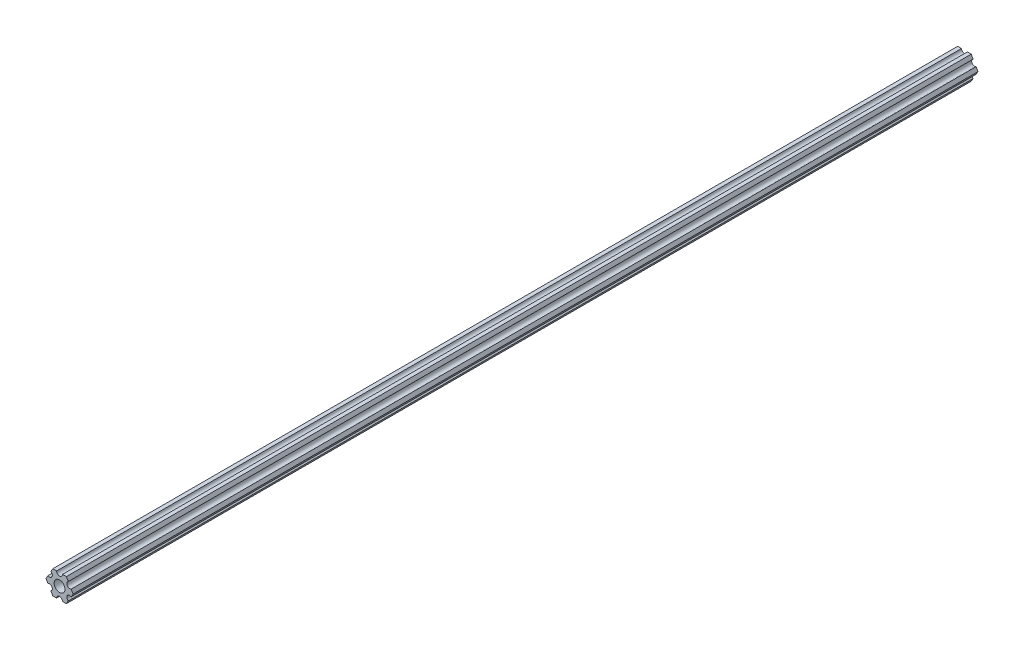
ISO-10303-21;
HEADER;
FILE_DESCRIPTION(('STEP AP214'),'2;1');
FILE_NAME('part.step','',(''),(''),'','','');
FILE_SCHEMA(('AUTOMOTIVE_DESIGN { 1 0 10303 214 1 1 1 1 }'));
ENDSEC;
DATA;
#1=APPLICATION_CONTEXT('core data for automotive mechanical design processes');
#2=APPLICATION_PROTOCOL_DEFINITION('international standard','automotive_design',2000,#1);
#3=PRODUCT_CONTEXT('',#1,'mechanical');
#4=PRODUCT('Part','Part','',(#3));
#5=PRODUCT_RELATED_PRODUCT_CATEGORY('part','',(#4));
#6=PRODUCT_DEFINITION_FORMATION('','',#4);
#7=PRODUCT_DEFINITION_CONTEXT('part definition',#1,'design');
#8=PRODUCT_DEFINITION('design','',#6,#7);
#9=PRODUCT_DEFINITION_SHAPE('','',#8);
#10=(LENGTH_UNIT() NAMED_UNIT(*) SI_UNIT(.MILLI.,.METRE.));
#11=(NAMED_UNIT(*) PLANE_ANGLE_UNIT() SI_UNIT($,.RADIAN.));
#12=(NAMED_UNIT(*) SI_UNIT($,.STERADIAN.) SOLID_ANGLE_UNIT());
#13=UNCERTAINTY_MEASURE_WITH_UNIT(LENGTH_MEASURE(1.E-05),#10,'distance_accuracy_value','');
#14=(GEOMETRIC_REPRESENTATION_CONTEXT(3) GLOBAL_UNCERTAINTY_ASSIGNED_CONTEXT((#13)) GLOBAL_UNIT_ASSIGNED_CONTEXT((#10,
#11,#12)) REPRESENTATION_CONTEXT('',''));
#15=CARTESIAN_POINT('',(0.,0.,0.));
#16=DIRECTION('',(0.,0.,1.));
#17=DIRECTION('',(1.,0.,0.));
#18=AXIS2_PLACEMENT_3D('',#15,#16,#17);
#19=CARTESIAN_POINT('',(5.49926112168156,3.17500033315933,488.95));
#20=DIRECTION('',(0.,0.,1.));
#21=DIRECTION('',(1.,0.,0.));
#22=AXIS2_PLACEMENT_3D('',#19,#20,#21);
#23=PLANE('',#22);
#24=DIRECTION('',(0.499999947533953,0.866025434075723,0.));
#25=VECTOR('',#24,1.);
#26=CARTESIAN_POINT('',(6.29301142309098,-1.80018429024546,488.95));
#27=LINE('',#26,#25);
#28=CARTESIAN_POINT('',(6.29301142309098,-1.80018429024546,488.95));
#29=VERTEX_POINT('',#28);
#30=CARTESIAN_POINT('',(7.33234841870826,4.44212519169686E-07,488.95));
#31=VERTEX_POINT('',#30);
#32=EDGE_CURVE('E226',#29,#31,#27,.T.);
#33=ORIENTED_EDGE('',*,*,#32,.T.);
#34=DIRECTION('',(-0.500000052466056,0.866025373493145,0.));
#35=VECTOR('',#34,1.);
#36=CARTESIAN_POINT('',(7.33234841870826,4.44212519169686E-07,488.95));
#37=LINE('',#36,#35);
#38=CARTESIAN_POINT('',(6.29301120497139,1.80018505273894,488.95));
#39=VERTEX_POINT('',#38);
#40=EDGE_CURVE('E124',#31,#39,#37,.T.);
#41=ORIENTED_EDGE('',*,*,#40,.T.);
#42=CARTESIAN_POINT('',(5.49926112168156,3.17500033315933,488.95));
#43=DIRECTION('',(0.,0.,-1.));
#44=DIRECTION('',(1.,0.,0.));
#45=AXIS2_PLACEMENT_3D('',#42,#43,#44);
#46=CIRCLE('',#45,1.5875);
#47=CARTESIAN_POINT('',(4.70551103839172,4.54981561357972,488.95));
#48=VERTEX_POINT('',#47);
#49=EDGE_CURVE('E271',#39,#48,#46,.T.);
#50=ORIENTED_EDGE('',*,*,#49,.T.);
#51=DIRECTION('',(-0.500000052466046,0.866025373493151,0.));
#52=VECTOR('',#51,1.);
#53=CARTESIAN_POINT('',(4.70551103839172,4.54981561357972,488.95));
#54=LINE('',#53,#52);
#55=CARTESIAN_POINT('',(3.66617382465481,6.35000022210627,488.95));
#56=VERTEX_POINT('',#55);
#57=EDGE_CURVE('E290',#48,#56,#54,.T.);
#58=ORIENTED_EDGE('',*,*,#57,.T.);
#59=DIRECTION('',(-0.999999999999998,-6.05825850611185E-08,0.));
#60=VECTOR('',#59,1.);
#61=CARTESIAN_POINT('',(3.66617382465481,6.35000022210627,488.95));
#62=LINE('',#61,#60);
#63=CARTESIAN_POINT('',(1.58749961530074,6.35000009617482,488.95));
#64=VERTEX_POINT('',#63);
#65=EDGE_CURVE('E287',#56,#64,#62,.T.);
#66=ORIENTED_EDGE('',*,*,#65,.T.);
#67=CARTESIAN_POINT('',(-3.84699260060323E-07,6.35,488.95));
#68=DIRECTION('',(0.,0.,-1.));
#69=DIRECTION('',(1.,0.,0.));
#70=AXIS2_PLACEMENT_3D('',#67,#68,#69);
#71=CIRCLE('',#70,1.5875);
#72=CARTESIAN_POINT('',(-1.58750038469926,6.34999990382518,488.95));
#73=VERTEX_POINT('',#72);
#74=EDGE_CURVE('E289',#64,#73,#71,.T.);
#75=ORIENTED_EDGE('',*,*,#74,.T.);
#76=DIRECTION('',(-0.999999999999998,-6.05825963273174E-08,0.));
#77=VECTOR('',#76,1.);
#78=CARTESIAN_POINT('',(-1.58750038469926,6.34999990382518,488.95));
#79=LINE('',#78,#77);
#80=CARTESIAN_POINT('',(-3.66617459405349,6.3499997778937,488.95));
#81=VERTEX_POINT('',#80);
#82=EDGE_CURVE('E292',#73,#81,#79,.T.);
#83=ORIENTED_EDGE('',*,*,#82,.T.);
#84=DIRECTION('',(-0.499999947533942,-0.866025434075729,0.));
#85=VECTOR('',#84,1.);
#86=CARTESIAN_POINT('',(-3.66617459405349,6.3499997778937,488.95));
#87=LINE('',#86,#85);
#88=CARTESIAN_POINT('',(-4.70551158967065,4.54981504343587,488.95));
#89=VERTEX_POINT('',#88);
#90=EDGE_CURVE('E298',#81,#89,#87,.T.);
#91=ORIENTED_EDGE('',*,*,#90,.T.);
#92=CARTESIAN_POINT('',(-5.49926150638082,3.17499966684067,488.95));
#93=DIRECTION('',(0.,0.,-1.));
#94=DIRECTION('',(1.,0.,0.));
#95=AXIS2_PLACEMENT_3D('',#92,#93,#94);
#96=CIRCLE('',#95,1.5875);
#97=CARTESIAN_POINT('',(-6.29301142309098,1.80018429024547,488.95));
#98=VERTEX_POINT('',#97);
#99=EDGE_CURVE('E300',#89,#98,#96,.T.);
#100=ORIENTED_EDGE('',*,*,#99,.T.);
#101=DIRECTION('',(-0.499999947533951,-0.866025434075724,0.));
#102=VECTOR('',#101,1.);
#103=CARTESIAN_POINT('',(-6.29301142309098,1.80018429024547,488.95));
#104=LINE('',#103,#102);
#105=CARTESIAN_POINT('',(-7.33234841870826,-4.44212523790841E-07,488.95));
#106=VERTEX_POINT('',#105);
#107=EDGE_CURVE('E302',#98,#106,#104,.T.);
#108=ORIENTED_EDGE('',*,*,#107,.T.);
#109=DIRECTION('',(0.500000052466045,-0.866025373493151,0.));
#110=VECTOR('',#109,1.);
#111=CARTESIAN_POINT('',(-7.33234841870826,-4.44212523790841E-07,488.95));
#112=LINE('',#111,#110);
#113=CARTESIAN_POINT('',(-6.29301120497141,-1.80018505273897,488.95));
#114=VERTEX_POINT('',#113);
#115=EDGE_CURVE('E304',#106,#114,#112,.T.);
#116=ORIENTED_EDGE('',*,*,#115,.T.);
#117=CARTESIAN_POINT('',(-5.49926112168156,-3.17500033315934,488.95));
#118=DIRECTION('',(0.,0.,-1.));
#119=DIRECTION('',(1.,0.,0.));
#120=AXIS2_PLACEMENT_3D('',#117,#118,#119);
#121=CIRCLE('',#120,1.5875);
#122=CARTESIAN_POINT('',(-4.70551103839172,-4.54981561357972,488.95));
#123=VERTEX_POINT('',#122);
#124=EDGE_CURVE('E306',#114,#123,#121,.T.);
#125=ORIENTED_EDGE('',*,*,#124,.T.);
#126=DIRECTION('',(0.500000052466045,-0.866025373493151,0.));
#127=VECTOR('',#126,1.);
#128=CARTESIAN_POINT('',(-4.70551103839172,-4.54981561357972,488.95));
#129=LINE('',#128,#127);
#130=CARTESIAN_POINT('',(-3.66617382465481,-6.35000022210628,488.95));
#131=VERTEX_POINT('',#130);
#132=EDGE_CURVE('E308',#123,#131,#129,.T.);
#133=ORIENTED_EDGE('',*,*,#132,.T.);
#134=DIRECTION('',(0.999999999999998,6.05825854783851E-08,0.));
#135=VECTOR('',#134,1.);
#136=CARTESIAN_POINT('',(-3.66617382465481,-6.35000022210628,488.95));
#137=LINE('',#136,#135);
#138=CARTESIAN_POINT('',(-1.58749961530074,-6.35000009617482,488.95));
#139=VERTEX_POINT('',#138);
#140=EDGE_CURVE('E310',#131,#139,#137,.T.);
#141=ORIENTED_EDGE('',*,*,#140,.T.);
#142=CARTESIAN_POINT('',(3.8469926204343E-07,-6.35,488.95));
#143=DIRECTION('',(0.,0.,-1.));
#144=DIRECTION('',(1.,0.,0.));
#145=AXIS2_PLACEMENT_3D('',#142,#143,#144);
#146=CIRCLE('',#145,1.5875);
#147=CARTESIAN_POINT('',(1.58750038469926,-6.34999990382518,488.95));
#148=VERTEX_POINT('',#147);
#149=EDGE_CURVE('E173',#139,#148,#146,.T.);
#150=ORIENTED_EDGE('',*,*,#149,.T.);
#151=DIRECTION('',(0.999999999999998,6.05825721258438E-08,0.));
#152=VECTOR('',#151,1.);
#153=CARTESIAN_POINT('',(1.58750038469926,-6.34999990382518,488.95));
#154=LINE('',#153,#152);
#155=CARTESIAN_POINT('',(3.66617459405346,-6.34999977789375,488.95));
#156=VERTEX_POINT('',#155);
#157=EDGE_CURVE('E167',#148,#156,#154,.T.);
#158=ORIENTED_EDGE('',*,*,#157,.T.);
#159=DIRECTION('',(0.499999947533941,0.86602543407573,0.));
#160=VECTOR('',#159,1.);
#161=CARTESIAN_POINT('',(3.66617459405346,-6.34999977789375,488.95));
#162=LINE('',#161,#160);
#163=CARTESIAN_POINT('',(4.70551158967065,-4.54981504343587,488.95));
#164=VERTEX_POINT('',#163);
#165=EDGE_CURVE('E171',#156,#164,#162,.T.);
#166=ORIENTED_EDGE('',*,*,#165,.T.);
#167=CARTESIAN_POINT('',(5.49926150638082,-3.17499966684067,488.95));
#168=DIRECTION('',(0.,0.,-1.));
#169=DIRECTION('',(1.,0.,0.));
#170=AXIS2_PLACEMENT_3D('',#167,#168,#169);
#171=CIRCLE('',#170,1.58750000000001);
#172=EDGE_CURVE('E51',#164,#29,#171,.T.);
#173=ORIENTED_EDGE('',*,*,#172,.T.);
#174=EDGE_LOOP('',(#33,#41,#50,#58,#66,#75,#83,#91,#100,#108,#116,#125,#133,#141,#150,#158,#166,#173));
#175=FACE_BOUND('',#174,.T.);
#176=CARTESIAN_POINT('',(0.,0.,488.95));
#177=DIRECTION('',(0.,0.,1.));
#178=DIRECTION('',(1.,0.,0.));
#179=AXIS2_PLACEMENT_3D('',#176,#177,#178);
#180=CIRCLE('',#179,2.9337);
#181=CARTESIAN_POINT('',(2.9337,0.,488.95));
#182=VERTEX_POINT('',#181);
#183=EDGE_CURVE('E195',#182,#182,#180,.T.);
#184=ORIENTED_EDGE('',*,*,#183,.F.);
#185=EDGE_LOOP('',(#184));
#186=FACE_BOUND('',#185,.T.);
#187=ADVANCED_FACE('F34',(#175,#186),#23,.T.);
#188=CARTESIAN_POINT('',(5.49926112168156,3.17500033315933,0.));
#189=DIRECTION('',(0.,0.,1.));
#190=DIRECTION('',(1.,0.,0.));
#191=AXIS2_PLACEMENT_3D('',#188,#189,#190);
#192=PLANE('',#191);
#193=DIRECTION('',(0.499999947533953,0.866025434075723,0.));
#194=VECTOR('',#193,1.);
#195=CARTESIAN_POINT('',(6.29301142309098,-1.80018429024546,0.));
#196=LINE('',#195,#194);
#197=CARTESIAN_POINT('',(6.29301142309098,-1.80018429024546,0.));
#198=VERTEX_POINT('',#197);
#199=CARTESIAN_POINT('',(7.33234841870826,4.44212519169686E-07,0.));
#200=VERTEX_POINT('',#199);
#201=EDGE_CURVE('E191',#198,#200,#196,.T.);
#202=ORIENTED_EDGE('',*,*,#201,.F.);
#203=CARTESIAN_POINT('',(5.49926150638082,-3.17499966684067,0.));
#204=DIRECTION('',(0.,0.,-1.));
#205=DIRECTION('',(1.,0.,0.));
#206=AXIS2_PLACEMENT_3D('',#203,#204,#205);
#207=CIRCLE('',#206,1.58750000000001);
#208=CARTESIAN_POINT('',(4.70551158967065,-4.54981504343587,0.));
#209=VERTEX_POINT('',#208);
#210=EDGE_CURVE('E116',#209,#198,#207,.T.);
#211=ORIENTED_EDGE('',*,*,#210,.F.);
#212=DIRECTION('',(0.499999947533941,0.86602543407573,0.));
#213=VECTOR('',#212,1.);
#214=CARTESIAN_POINT('',(3.66617459405346,-6.34999977789375,0.));
#215=LINE('',#214,#213);
#216=CARTESIAN_POINT('',(3.66617459405346,-6.34999977789375,0.));
#217=VERTEX_POINT('',#216);
#218=EDGE_CURVE('E110',#217,#209,#215,.T.);
#219=ORIENTED_EDGE('',*,*,#218,.F.);
#220=DIRECTION('',(0.999999999999998,6.05825721258438E-08,0.));
#221=VECTOR('',#220,1.);
#222=CARTESIAN_POINT('',(1.58750038469926,-6.34999990382518,0.));
#223=LINE('',#222,#221);
#224=CARTESIAN_POINT('',(1.58750038469926,-6.34999990382518,0.));
#225=VERTEX_POINT('',#224);
#226=EDGE_CURVE('E181',#225,#217,#223,.T.);
#227=ORIENTED_EDGE('',*,*,#226,.F.);
#228=CARTESIAN_POINT('',(3.8469926204343E-07,-6.35,0.));
#229=DIRECTION('',(0.,0.,-1.));
#230=DIRECTION('',(1.,0.,0.));
#231=AXIS2_PLACEMENT_3D('',#228,#229,#230);
#232=CIRCLE('',#231,1.5875);
#233=CARTESIAN_POINT('',(-1.58749961530074,-6.35000009617482,0.));
#234=VERTEX_POINT('',#233);
#235=EDGE_CURVE('E221',#234,#225,#232,.T.);
#236=ORIENTED_EDGE('',*,*,#235,.F.);
#237=DIRECTION('',(0.999999999999998,6.05825854783851E-08,0.));
#238=VECTOR('',#237,1.);
#239=CARTESIAN_POINT('',(-3.66617382465481,-6.35000022210628,0.));
#240=LINE('',#239,#238);
#241=CARTESIAN_POINT('',(-3.66617382465481,-6.35000022210628,0.));
#242=VERTEX_POINT('',#241);
#243=EDGE_CURVE('E219',#242,#234,#240,.T.);
#244=ORIENTED_EDGE('',*,*,#243,.F.);
#245=DIRECTION('',(0.500000052466045,-0.866025373493151,0.));
#246=VECTOR('',#245,1.);
#247=CARTESIAN_POINT('',(-4.70551103839172,-4.54981561357972,0.));
#248=LINE('',#247,#246);
#249=CARTESIAN_POINT('',(-4.70551103839172,-4.54981561357972,0.));
#250=VERTEX_POINT('',#249);
#251=EDGE_CURVE('E217',#250,#242,#248,.T.);
#252=ORIENTED_EDGE('',*,*,#251,.F.);
#253=CARTESIAN_POINT('',(-5.49926112168156,-3.17500033315934,0.));
#254=DIRECTION('',(0.,0.,-1.));
#255=DIRECTION('',(1.,0.,0.));
#256=AXIS2_PLACEMENT_3D('',#253,#254,#255);
#257=CIRCLE('',#256,1.5875);
#258=CARTESIAN_POINT('',(-6.29301120497141,-1.80018505273897,0.));
#259=VERTEX_POINT('',#258);
#260=EDGE_CURVE('E215',#259,#250,#257,.T.);
#261=ORIENTED_EDGE('',*,*,#260,.F.);
#262=DIRECTION('',(0.500000052466045,-0.866025373493151,0.));
#263=VECTOR('',#262,1.);
#264=CARTESIAN_POINT('',(-7.33234841870826,-4.44212523790841E-07,0.));
#265=LINE('',#264,#263);
#266=CARTESIAN_POINT('',(-7.33234841870826,-4.44212523790841E-07,0.));
#267=VERTEX_POINT('',#266);
#268=EDGE_CURVE('E213',#267,#259,#265,.T.);
#269=ORIENTED_EDGE('',*,*,#268,.F.);
#270=DIRECTION('',(-0.499999947533951,-0.866025434075724,0.));
#271=VECTOR('',#270,1.);
#272=CARTESIAN_POINT('',(-6.29301142309098,1.80018429024547,0.));
#273=LINE('',#272,#271);
#274=CARTESIAN_POINT('',(-6.29301142309098,1.80018429024547,0.));
#275=VERTEX_POINT('',#274);
#276=EDGE_CURVE('E211',#275,#267,#273,.T.);
#277=ORIENTED_EDGE('',*,*,#276,.F.);
#278=CARTESIAN_POINT('',(-5.49926150638082,3.17499966684067,0.));
#279=DIRECTION('',(0.,0.,-1.));
#280=DIRECTION('',(1.,0.,0.));
#281=AXIS2_PLACEMENT_3D('',#278,#279,#280);
#282=CIRCLE('',#281,1.5875);
#283=CARTESIAN_POINT('',(-4.70551158967065,4.54981504343587,0.));
#284=VERTEX_POINT('',#283);
#285=EDGE_CURVE('E209',#284,#275,#282,.T.);
#286=ORIENTED_EDGE('',*,*,#285,.F.);
#287=DIRECTION('',(-0.499999947533942,-0.866025434075729,0.));
#288=VECTOR('',#287,1.);
#289=CARTESIAN_POINT('',(-3.66617459405349,6.3499997778937,0.));
#290=LINE('',#289,#288);
#291=CARTESIAN_POINT('',(-3.66617459405349,6.3499997778937,0.));
#292=VERTEX_POINT('',#291);
#293=EDGE_CURVE('E207',#292,#284,#290,.T.);
#294=ORIENTED_EDGE('',*,*,#293,.F.);
#295=DIRECTION('',(-0.999999999999998,-6.05825963273174E-08,0.));
#296=VECTOR('',#295,1.);
#297=CARTESIAN_POINT('',(-1.58750038469926,6.34999990382518,0.));
#298=LINE('',#297,#296);
#299=CARTESIAN_POINT('',(-1.58750038469926,6.34999990382518,0.));
#300=VERTEX_POINT('',#299);
#301=EDGE_CURVE('E205',#300,#292,#298,.T.);
#302=ORIENTED_EDGE('',*,*,#301,.F.);
#303=CARTESIAN_POINT('',(-3.84699260060323E-07,6.35,0.));
#304=DIRECTION('',(0.,0.,-1.));
#305=DIRECTION('',(1.,0.,0.));
#306=AXIS2_PLACEMENT_3D('',#303,#304,#305);
#307=CIRCLE('',#306,1.5875);
#308=CARTESIAN_POINT('',(1.58749961530074,6.35000009617482,0.));
#309=VERTEX_POINT('',#308);
#310=EDGE_CURVE('E203',#309,#300,#307,.T.);
#311=ORIENTED_EDGE('',*,*,#310,.F.);
#312=DIRECTION('',(-0.999999999999998,-6.05825850611185E-08,0.));
#313=VECTOR('',#312,1.);
#314=CARTESIAN_POINT('',(3.66617382465481,6.35000022210627,0.));
#315=LINE('',#314,#313);
#316=CARTESIAN_POINT('',(3.66617382465481,6.35000022210627,0.));
#317=VERTEX_POINT('',#316);
#318=EDGE_CURVE('E201',#317,#309,#315,.T.);
#319=ORIENTED_EDGE('',*,*,#318,.F.);
#320=DIRECTION('',(-0.500000052466046,0.866025373493151,0.));
#321=VECTOR('',#320,1.);
#322=CARTESIAN_POINT('',(4.70551103839172,4.54981561357972,0.));
#323=LINE('',#322,#321);
#324=CARTESIAN_POINT('',(4.70551103839172,4.54981561357972,0.));
#325=VERTEX_POINT('',#324);
#326=EDGE_CURVE('E199',#325,#317,#323,.T.);
#327=ORIENTED_EDGE('',*,*,#326,.F.);
#328=CARTESIAN_POINT('',(5.49926112168156,3.17500033315933,0.));
#329=DIRECTION('',(0.,0.,-1.));
#330=DIRECTION('',(1.,0.,0.));
#331=AXIS2_PLACEMENT_3D('',#328,#329,#330);
#332=CIRCLE('',#331,1.5875);
#333=CARTESIAN_POINT('',(6.29301120497139,1.80018505273894,0.));
#334=VERTEX_POINT('',#333);
#335=EDGE_CURVE('E197',#334,#325,#332,.T.);
#336=ORIENTED_EDGE('',*,*,#335,.F.);
#337=DIRECTION('',(-0.500000052466056,0.866025373493145,0.));
#338=VECTOR('',#337,1.);
#339=CARTESIAN_POINT('',(7.33234841870826,4.44212519169686E-07,0.));
#340=LINE('',#339,#338);
#341=EDGE_CURVE('E194',#200,#334,#340,.T.);
#342=ORIENTED_EDGE('',*,*,#341,.F.);
#343=EDGE_LOOP('',(#202,#211,#219,#227,#236,#244,#252,#261,#269,#277,#286,#294,#302,#311,#319,
#327,#336,#342));
#344=FACE_BOUND('',#343,.T.);
#345=CARTESIAN_POINT('',(0.,0.,0.));
#346=DIRECTION('',(0.,0.,1.));
#347=DIRECTION('',(1.,0.,0.));
#348=AXIS2_PLACEMENT_3D('',#345,#346,#347);
#349=CIRCLE('',#348,2.9337);
#350=CARTESIAN_POINT('',(2.9337,0.,0.));
#351=VERTEX_POINT('',#350);
#352=EDGE_CURVE('E535',#351,#351,#349,.T.);
#353=ORIENTED_EDGE('',*,*,#352,.T.);
#354=EDGE_LOOP('',(#353));
#355=FACE_BOUND('',#354,.T.);
#356=ADVANCED_FACE('F275',(#344,#355),#192,.F.);
#357=CARTESIAN_POINT('',(6.29301142309098,-1.80018429024546,488.95));
#358=DIRECTION('',(-0.866025434075723,0.499999947533953,0.));
#359=DIRECTION('',(-0.499999947533953,-0.866025434075723,0.));
#360=AXIS2_PLACEMENT_3D('',#357,#358,#359);
#361=PLANE('',#360);
#362=ORIENTED_EDGE('',*,*,#201,.T.);
#363=DIRECTION('',(0.,0.,-1.));
#364=VECTOR('',#363,1.);
#365=CARTESIAN_POINT('',(7.33234841870826,4.44212519169686E-07,488.95));
#366=LINE('',#365,#364);
#367=EDGE_CURVE('E11',#31,#200,#366,.T.);
#368=ORIENTED_EDGE('',*,*,#367,.F.);
#369=ORIENTED_EDGE('',*,*,#32,.F.);
#370=DIRECTION('',(0.,0.,-1.));
#371=VECTOR('',#370,1.);
#372=CARTESIAN_POINT('',(6.29301142309098,-1.80018429024546,488.95));
#373=LINE('',#372,#371);
#374=EDGE_CURVE('E187',#29,#198,#373,.T.);
#375=ORIENTED_EDGE('',*,*,#374,.T.);
#376=EDGE_LOOP('',(#362,#368,#369,#375));
#377=FACE_BOUND('',#376,.T.);
#378=ADVANCED_FACE('F36',(#377),#361,.F.);
#379=CARTESIAN_POINT('',(7.33234841870826,4.44212519169686E-07,488.95));
#380=DIRECTION('',(-0.866025373493145,-0.500000052466057,0.));
#381=DIRECTION('',(0.500000052466056,-0.866025373493145,0.));
#382=AXIS2_PLACEMENT_3D('',#379,#380,#381);
#383=PLANE('',#382);
#384=ORIENTED_EDGE('',*,*,#341,.T.);
#385=DIRECTION('',(0.,0.,-1.));
#386=VECTOR('',#385,1.);
#387=CARTESIAN_POINT('',(6.29301120497139,1.80018505273894,488.95));
#388=LINE('',#387,#386);
#389=EDGE_CURVE('E43',#39,#334,#388,.T.);
#390=ORIENTED_EDGE('',*,*,#389,.F.);
#391=ORIENTED_EDGE('',*,*,#40,.F.);
#392=ORIENTED_EDGE('',*,*,#367,.T.);
#393=EDGE_LOOP('',(#384,#390,#391,#392));
#394=FACE_BOUND('',#393,.T.);
#395=ADVANCED_FACE('F344',(#394),#383,.F.);
#396=CARTESIAN_POINT('',(5.49926112168156,3.17500033315933,488.95));
#397=DIRECTION('',(0.,0.,-1.));
#398=DIRECTION('',(-1.,0.,0.));
#399=AXIS2_PLACEMENT_3D('',#396,#397,#398);
#400=CYLINDRICAL_SURFACE('',#399,1.5875);
#401=ORIENTED_EDGE('',*,*,#335,.T.);
#402=DIRECTION('',(0.,0.,-1.));
#403=VECTOR('',#402,1.);
#404=CARTESIAN_POINT('',(4.70551103839172,4.54981561357972,488.95));
#405=LINE('',#404,#403);
#406=EDGE_CURVE('E263',#48,#325,#405,.T.);
#407=ORIENTED_EDGE('',*,*,#406,.F.);
#408=ORIENTED_EDGE('',*,*,#49,.F.);
#409=ORIENTED_EDGE('',*,*,#389,.T.);
#410=EDGE_LOOP('',(#401,#407,#408,#409));
#411=FACE_BOUND('',#410,.T.);
#412=ADVANCED_FACE('F269',(#411),#400,.F.);
#413=CARTESIAN_POINT('',(4.70551103839172,4.54981561357972,488.95));
#414=DIRECTION('',(-0.866025373493151,-0.500000052466046,0.));
#415=DIRECTION('',(0.500000052466046,-0.866025373493151,0.));
#416=AXIS2_PLACEMENT_3D('',#413,#414,#415);
#417=PLANE('',#416);
#418=ORIENTED_EDGE('',*,*,#326,.T.);
#419=DIRECTION('',(0.,0.,-1.));
#420=VECTOR('',#419,1.);
#421=CARTESIAN_POINT('',(3.66617382465481,6.35000022210627,488.95));
#422=LINE('',#421,#420);
#423=EDGE_CURVE('E260',#56,#317,#422,.T.);
#424=ORIENTED_EDGE('',*,*,#423,.F.);
#425=ORIENTED_EDGE('',*,*,#57,.F.);
#426=ORIENTED_EDGE('',*,*,#406,.T.);
#427=EDGE_LOOP('',(#418,#424,#425,#426));
#428=FACE_BOUND('',#427,.T.);
#429=ADVANCED_FACE('F281',(#428),#417,.F.);
#430=CARTESIAN_POINT('',(3.66617382465481,6.35000022210627,488.95));
#431=DIRECTION('',(6.05825850611185E-08,-0.999999999999998,0.));
#432=DIRECTION('',(0.999999999999998,6.05825850611185E-08,0.));
#433=AXIS2_PLACEMENT_3D('',#430,#431,#432);
#434=PLANE('',#433);
#435=ORIENTED_EDGE('',*,*,#318,.T.);
#436=DIRECTION('',(0.,0.,-1.));
#437=VECTOR('',#436,1.);
#438=CARTESIAN_POINT('',(1.58749961530074,6.35000009617482,488.95));
#439=LINE('',#438,#437);
#440=EDGE_CURVE('E257',#64,#309,#439,.T.);
#441=ORIENTED_EDGE('',*,*,#440,.F.);
#442=ORIENTED_EDGE('',*,*,#65,.F.);
#443=ORIENTED_EDGE('',*,*,#423,.T.);
#444=EDGE_LOOP('',(#435,#441,#442,#443));
#445=FACE_BOUND('',#444,.T.);
#446=ADVANCED_FACE('F285',(#445),#434,.F.);
#447=CARTESIAN_POINT('',(-3.84699260060323E-07,6.35,488.95));
#448=DIRECTION('',(0.,0.,-1.));
#449=DIRECTION('',(-1.,0.,0.));
#450=AXIS2_PLACEMENT_3D('',#447,#448,#449);
#451=CYLINDRICAL_SURFACE('',#450,1.5875);
#452=ORIENTED_EDGE('',*,*,#310,.T.);
#453=DIRECTION('',(0.,0.,-1.));
#454=VECTOR('',#453,1.);
#455=CARTESIAN_POINT('',(-1.58750038469926,6.34999990382518,488.95));
#456=LINE('',#455,#454);
#457=EDGE_CURVE('E254',#73,#300,#456,.T.);
#458=ORIENTED_EDGE('',*,*,#457,.F.);
#459=ORIENTED_EDGE('',*,*,#74,.F.);
#460=ORIENTED_EDGE('',*,*,#440,.T.);
#461=EDGE_LOOP('',(#452,#458,#459,#460));
#462=FACE_BOUND('',#461,.T.);
#463=ADVANCED_FACE('F357',(#462),#451,.F.);
#464=CARTESIAN_POINT('',(-1.58750038469926,6.34999990382518,488.95));
#465=DIRECTION('',(6.05825963273174E-08,-0.999999999999998,0.));
#466=DIRECTION('',(0.999999999999998,6.05825963273174E-08,0.));
#467=AXIS2_PLACEMENT_3D('',#464,#465,#466);
#468=PLANE('',#467);
#469=ORIENTED_EDGE('',*,*,#301,.T.);
#470=DIRECTION('',(0.,0.,-1.));
#471=VECTOR('',#470,1.);
#472=CARTESIAN_POINT('',(-3.66617459405349,6.3499997778937,488.95));
#473=LINE('',#472,#471);
#474=EDGE_CURVE('E251',#81,#292,#473,.T.);
#475=ORIENTED_EDGE('',*,*,#474,.F.);
#476=ORIENTED_EDGE('',*,*,#82,.F.);
#477=ORIENTED_EDGE('',*,*,#457,.T.);
#478=EDGE_LOOP('',(#469,#475,#476,#477));
#479=FACE_BOUND('',#478,.T.);
#480=ADVANCED_FACE('F360',(#479),#468,.F.);
#481=CARTESIAN_POINT('',(-3.66617459405349,6.3499997778937,488.95));
#482=DIRECTION('',(0.866025434075729,-0.499999947533942,0.));
#483=DIRECTION('',(0.499999947533943,0.866025434075729,0.));
#484=AXIS2_PLACEMENT_3D('',#481,#482,#483);
#485=PLANE('',#484);
#486=ORIENTED_EDGE('',*,*,#293,.T.);
#487=DIRECTION('',(0.,0.,-1.));
#488=VECTOR('',#487,1.);
#489=CARTESIAN_POINT('',(-4.70551158967065,4.54981504343587,488.95));
#490=LINE('',#489,#488);
#491=EDGE_CURVE('E248',#89,#284,#490,.T.);
#492=ORIENTED_EDGE('',*,*,#491,.F.);
#493=ORIENTED_EDGE('',*,*,#90,.F.);
#494=ORIENTED_EDGE('',*,*,#474,.T.);
#495=EDGE_LOOP('',(#486,#492,#493,#494));
#496=FACE_BOUND('',#495,.T.);
#497=ADVANCED_FACE('F364',(#496),#485,.F.);
#498=CARTESIAN_POINT('',(-5.49926150638082,3.17499966684067,488.95));
#499=DIRECTION('',(0.,0.,-1.));
#500=DIRECTION('',(-1.,0.,0.));
#501=AXIS2_PLACEMENT_3D('',#498,#499,#500);
#502=CYLINDRICAL_SURFACE('',#501,1.5875);
#503=ORIENTED_EDGE('',*,*,#285,.T.);
#504=DIRECTION('',(0.,0.,-1.));
#505=VECTOR('',#504,1.);
#506=CARTESIAN_POINT('',(-6.29301142309098,1.80018429024547,488.95));
#507=LINE('',#506,#505);
#508=EDGE_CURVE('E245',#98,#275,#507,.T.);
#509=ORIENTED_EDGE('',*,*,#508,.F.);
#510=ORIENTED_EDGE('',*,*,#99,.F.);
#511=ORIENTED_EDGE('',*,*,#491,.T.);
#512=EDGE_LOOP('',(#503,#509,#510,#511));
#513=FACE_BOUND('',#512,.T.);
#514=ADVANCED_FACE('F368',(#513),#502,.F.);
#515=CARTESIAN_POINT('',(-6.29301142309098,1.80018429024547,488.95));
#516=DIRECTION('',(0.866025434075724,-0.499999947533952,0.));
#517=DIRECTION('',(0.499999947533952,0.866025434075724,0.));
#518=AXIS2_PLACEMENT_3D('',#515,#516,#517);
#519=PLANE('',#518);
#520=ORIENTED_EDGE('',*,*,#276,.T.);
#521=DIRECTION('',(0.,0.,-1.));
#522=VECTOR('',#521,1.);
#523=CARTESIAN_POINT('',(-7.33234841870826,-4.44212523790841E-07,488.95));
#524=LINE('',#523,#522);
#525=EDGE_CURVE('E242',#106,#267,#524,.T.);
#526=ORIENTED_EDGE('',*,*,#525,.F.);
#527=ORIENTED_EDGE('',*,*,#107,.F.);
#528=ORIENTED_EDGE('',*,*,#508,.T.);
#529=EDGE_LOOP('',(#520,#526,#527,#528));
#530=FACE_BOUND('',#529,.T.);
#531=ADVANCED_FACE('F372',(#530),#519,.F.);
#532=CARTESIAN_POINT('',(-7.33234841870826,-4.44212523790841E-07,488.95));
#533=DIRECTION('',(0.866025373493151,0.500000052466045,0.));
#534=DIRECTION('',(-0.500000052466045,0.866025373493151,0.));
#535=AXIS2_PLACEMENT_3D('',#532,#533,#534);
#536=PLANE('',#535);
#537=ORIENTED_EDGE('',*,*,#268,.T.);
#538=DIRECTION('',(0.,0.,-1.));
#539=VECTOR('',#538,1.);
#540=CARTESIAN_POINT('',(-6.29301120497141,-1.80018505273897,488.95));
#541=LINE('',#540,#539);
#542=EDGE_CURVE('E239',#114,#259,#541,.T.);
#543=ORIENTED_EDGE('',*,*,#542,.F.);
#544=ORIENTED_EDGE('',*,*,#115,.F.);
#545=ORIENTED_EDGE('',*,*,#525,.T.);
#546=EDGE_LOOP('',(#537,#543,#544,#545));
#547=FACE_BOUND('',#546,.T.);
#548=ADVANCED_FACE('F376',(#547),#536,.F.);
#549=CARTESIAN_POINT('',(-5.49926112168156,-3.17500033315934,488.95));
#550=DIRECTION('',(0.,0.,-1.));
#551=DIRECTION('',(-1.,0.,0.));
#552=AXIS2_PLACEMENT_3D('',#549,#550,#551);
#553=CYLINDRICAL_SURFACE('',#552,1.5875);
#554=ORIENTED_EDGE('',*,*,#260,.T.);
#555=DIRECTION('',(0.,0.,-1.));
#556=VECTOR('',#555,1.);
#557=CARTESIAN_POINT('',(-4.70551103839172,-4.54981561357972,488.95));
#558=LINE('',#557,#556);
#559=EDGE_CURVE('E236',#123,#250,#558,.T.);
#560=ORIENTED_EDGE('',*,*,#559,.F.);
#561=ORIENTED_EDGE('',*,*,#124,.F.);
#562=ORIENTED_EDGE('',*,*,#542,.T.);
#563=EDGE_LOOP('',(#554,#560,#561,#562));
#564=FACE_BOUND('',#563,.T.);
#565=ADVANCED_FACE('F380',(#564),#553,.F.);
#566=CARTESIAN_POINT('',(-4.70551103839172,-4.54981561357972,488.95));
#567=DIRECTION('',(0.866025373493151,0.500000052466045,0.));
#568=DIRECTION('',(-0.500000052466045,0.866025373493151,0.));
#569=AXIS2_PLACEMENT_3D('',#566,#567,#568);
#570=PLANE('',#569);
#571=ORIENTED_EDGE('',*,*,#251,.T.);
#572=DIRECTION('',(0.,0.,-1.));
#573=VECTOR('',#572,1.);
#574=CARTESIAN_POINT('',(-3.66617382465481,-6.35000022210628,488.95));
#575=LINE('',#574,#573);
#576=EDGE_CURVE('E233',#131,#242,#575,.T.);
#577=ORIENTED_EDGE('',*,*,#576,.F.);
#578=ORIENTED_EDGE('',*,*,#132,.F.);
#579=ORIENTED_EDGE('',*,*,#559,.T.);
#580=EDGE_LOOP('',(#571,#577,#578,#579));
#581=FACE_BOUND('',#580,.T.);
#582=ADVANCED_FACE('F384',(#581),#570,.F.);
#583=CARTESIAN_POINT('',(-3.66617382465481,-6.35000022210628,488.95));
#584=DIRECTION('',(-6.05825854783851E-08,0.999999999999998,0.));
#585=DIRECTION('',(-0.999999999999998,-6.05825854783851E-08,0.));
#586=AXIS2_PLACEMENT_3D('',#583,#584,#585);
#587=PLANE('',#586);
#588=ORIENTED_EDGE('',*,*,#243,.T.);
#589=DIRECTION('',(0.,0.,-1.));
#590=VECTOR('',#589,1.);
#591=CARTESIAN_POINT('',(-1.58749961530074,-6.35000009617482,488.95));
#592=LINE('',#591,#590);
#593=EDGE_CURVE('E230',#139,#234,#592,.T.);
#594=ORIENTED_EDGE('',*,*,#593,.F.);
#595=ORIENTED_EDGE('',*,*,#140,.F.);
#596=ORIENTED_EDGE('',*,*,#576,.T.);
#597=EDGE_LOOP('',(#588,#594,#595,#596));
#598=FACE_BOUND('',#597,.T.);
#599=ADVANCED_FACE('F316',(#598),#587,.F.);
#600=CARTESIAN_POINT('',(3.8469926204343E-07,-6.35,488.95));
#601=DIRECTION('',(0.,0.,-1.));
#602=DIRECTION('',(-1.,0.,0.));
#603=AXIS2_PLACEMENT_3D('',#600,#601,#602);
#604=CYLINDRICAL_SURFACE('',#603,1.5875);
#605=ORIENTED_EDGE('',*,*,#235,.T.);
#606=DIRECTION('',(0.,0.,-1.));
#607=VECTOR('',#606,1.);
#608=CARTESIAN_POINT('',(1.58750038469926,-6.34999990382518,488.95));
#609=LINE('',#608,#607);
#610=EDGE_CURVE('E182',#148,#225,#609,.T.);
#611=ORIENTED_EDGE('',*,*,#610,.F.);
#612=ORIENTED_EDGE('',*,*,#149,.F.);
#613=ORIENTED_EDGE('',*,*,#593,.T.);
#614=EDGE_LOOP('',(#605,#611,#612,#613));
#615=FACE_BOUND('',#614,.T.);
#616=ADVANCED_FACE('F320',(#615),#604,.F.);
#617=CARTESIAN_POINT('',(1.58750038469926,-6.34999990382518,488.95));
#618=DIRECTION('',(-6.05825721258438E-08,0.999999999999998,0.));
#619=DIRECTION('',(-0.999999999999998,-6.05825721258438E-08,0.));
#620=AXIS2_PLACEMENT_3D('',#617,#618,#619);
#621=PLANE('',#620);
#622=ORIENTED_EDGE('',*,*,#226,.T.);
#623=DIRECTION('',(0.,0.,-1.));
#624=VECTOR('',#623,1.);
#625=CARTESIAN_POINT('',(3.66617459405346,-6.34999977789375,488.95));
#626=LINE('',#625,#624);
#627=EDGE_CURVE('E178',#156,#217,#626,.T.);
#628=ORIENTED_EDGE('',*,*,#627,.F.);
#629=ORIENTED_EDGE('',*,*,#157,.F.);
#630=ORIENTED_EDGE('',*,*,#610,.T.);
#631=EDGE_LOOP('',(#622,#628,#629,#630));
#632=FACE_BOUND('',#631,.T.);
#633=ADVANCED_FACE('F179',(#632),#621,.F.);
#634=CARTESIAN_POINT('',(3.66617459405346,-6.34999977789375,488.95));
#635=DIRECTION('',(-0.86602543407573,0.499999947533941,0.));
#636=DIRECTION('',(-0.499999947533941,-0.86602543407573,0.));
#637=AXIS2_PLACEMENT_3D('',#634,#635,#636);
#638=PLANE('',#637);
#639=ORIENTED_EDGE('',*,*,#218,.T.);
#640=DIRECTION('',(0.,0.,-1.));
#641=VECTOR('',#640,1.);
#642=CARTESIAN_POINT('',(4.70551158967065,-4.54981504343587,488.95));
#643=LINE('',#642,#641);
#644=EDGE_CURVE('E183',#164,#209,#643,.T.);
#645=ORIENTED_EDGE('',*,*,#644,.F.);
#646=ORIENTED_EDGE('',*,*,#165,.F.);
#647=ORIENTED_EDGE('',*,*,#627,.T.);
#648=EDGE_LOOP('',(#639,#645,#646,#647));
#649=FACE_BOUND('',#648,.T.);
#650=ADVANCED_FACE('F185',(#649),#638,.F.);
#651=CARTESIAN_POINT('',(5.49926150638082,-3.17499966684067,488.95));
#652=DIRECTION('',(0.,0.,-1.));
#653=DIRECTION('',(-1.,0.,0.));
#654=AXIS2_PLACEMENT_3D('',#651,#652,#653);
#655=CYLINDRICAL_SURFACE('',#654,1.58750000000001);
#656=ORIENTED_EDGE('',*,*,#210,.T.);
#657=ORIENTED_EDGE('',*,*,#374,.F.);
#658=ORIENTED_EDGE('',*,*,#172,.F.);
#659=ORIENTED_EDGE('',*,*,#644,.T.);
#660=EDGE_LOOP('',(#656,#657,#658,#659));
#661=FACE_BOUND('',#660,.T.);
#662=ADVANCED_FACE('F324',(#661),#655,.F.);
#663=CARTESIAN_POINT('',(0.,0.,488.95));
#664=DIRECTION('',(0.,0.,-1.));
#665=DIRECTION('',(-1.,0.,0.));
#666=AXIS2_PLACEMENT_3D('',#663,#664,#665);
#667=CYLINDRICAL_SURFACE('',#666,2.9337);
#668=ORIENTED_EDGE('',*,*,#183,.T.);
#669=EDGE_LOOP('',(#668));
#670=FACE_BOUND('',#669,.T.);
#671=ORIENTED_EDGE('',*,*,#352,.F.);
#672=EDGE_LOOP('',(#671));
#673=FACE_BOUND('',#672,.T.);
#674=ADVANCED_FACE('F326',(#670,#673),#667,.F.);
#675=CLOSED_SHELL('',(#187,#356,#378,#395,#412,#429,#446,#463,#480,#497,#514,#531,#548,#565,
#582,#599,#616,#633,#650,#662,#674));
#676=MANIFOLD_SOLID_BREP('B2',#675);
#677=ADVANCED_BREP_SHAPE_REPRESENTATION('',(#18,#676),#14);
#678=SHAPE_DEFINITION_REPRESENTATION(#9,#677);
ENDSEC;
END-ISO-10303-21;
